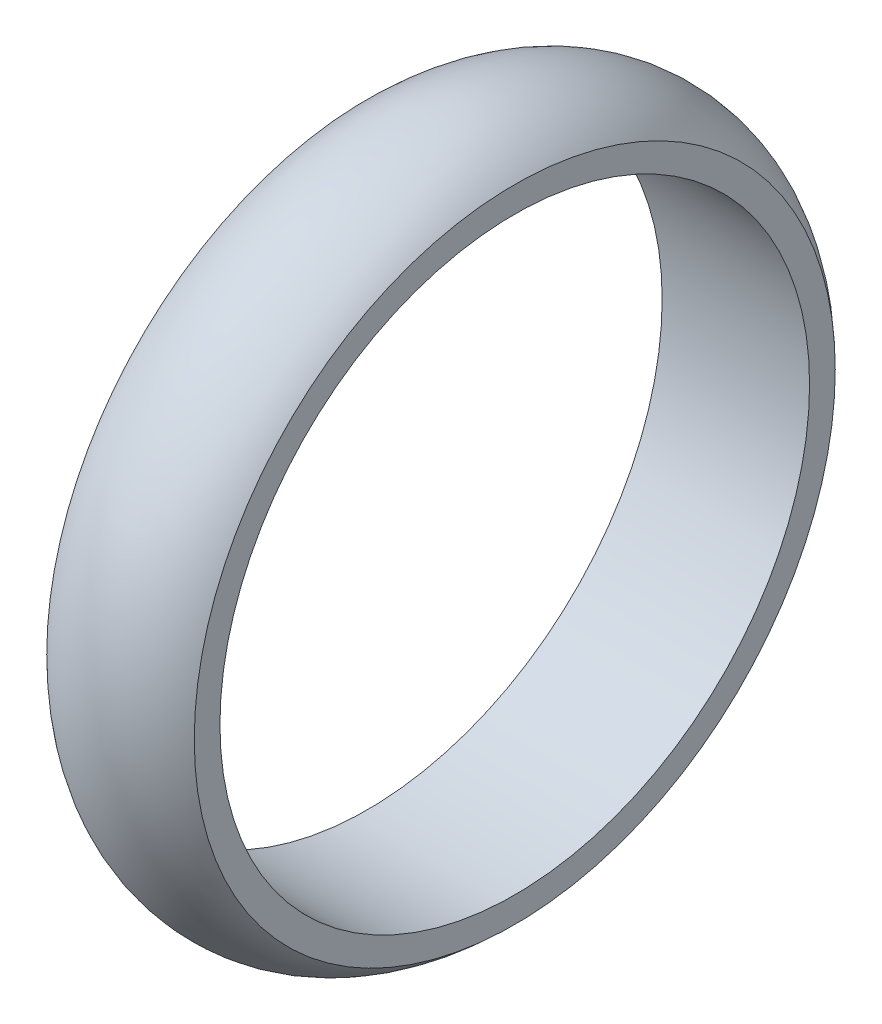
ISO-10303-21;
HEADER;
FILE_DESCRIPTION(('STEP AP214'),'2;1');
FILE_NAME('part.step','',(''),(''),'','','');
FILE_SCHEMA(('AUTOMOTIVE_DESIGN { 1 0 10303 214 1 1 1 1 }'));
ENDSEC;
DATA;
#1=APPLICATION_CONTEXT('core data for automotive mechanical design processes');
#2=APPLICATION_PROTOCOL_DEFINITION('international standard','automotive_design',2000,#1);
#3=PRODUCT_CONTEXT('',#1,'mechanical');
#4=PRODUCT('Part','Part','',(#3));
#5=PRODUCT_RELATED_PRODUCT_CATEGORY('part','',(#4));
#6=PRODUCT_DEFINITION_FORMATION('','',#4);
#7=PRODUCT_DEFINITION_CONTEXT('part definition',#1,'design');
#8=PRODUCT_DEFINITION('design','',#6,#7);
#9=PRODUCT_DEFINITION_SHAPE('','',#8);
#10=(LENGTH_UNIT() NAMED_UNIT(*) SI_UNIT(.MILLI.,.METRE.));
#11=(NAMED_UNIT(*) PLANE_ANGLE_UNIT() SI_UNIT($,.RADIAN.));
#12=(NAMED_UNIT(*) SI_UNIT($,.STERADIAN.) SOLID_ANGLE_UNIT());
#13=UNCERTAINTY_MEASURE_WITH_UNIT(LENGTH_MEASURE(1.E-05),#10,'distance_accuracy_value','');
#14=(GEOMETRIC_REPRESENTATION_CONTEXT(3) GLOBAL_UNCERTAINTY_ASSIGNED_CONTEXT((#13)) GLOBAL_UNIT_ASSIGNED_CONTEXT((#10,
#11,#12)) REPRESENTATION_CONTEXT('',''));
#15=CARTESIAN_POINT('',(0.,0.,0.));
#16=DIRECTION('',(0.,0.,1.));
#17=DIRECTION('',(1.,0.,0.));
#18=AXIS2_PLACEMENT_3D('',#15,#16,#17);
#19=CARTESIAN_POINT('',(-19.7853367191945,0.,0.));
#20=DIRECTION('',(-1.,0.,0.));
#21=DIRECTION('',(0.,0.,1.));
#22=AXIS2_PLACEMENT_3D('',#19,#20,#21);
#23=CYLINDRICAL_SURFACE('',#22,228.6);
#24=CARTESIAN_POINT('',(57.15,0.,0.));
#25=DIRECTION('',(-1.,0.,0.));
#26=DIRECTION('',(0.,0.,1.));
#27=AXIS2_PLACEMENT_3D('',#24,#25,#26);
#28=CIRCLE('',#27,228.6);
#29=CARTESIAN_POINT('',(57.15,0.,228.6));
#30=VERTEX_POINT('',#29);
#31=EDGE_CURVE('E10',#30,#30,#28,.T.);
#32=ORIENTED_EDGE('',*,*,#31,.F.);
#33=EDGE_LOOP('',(#32));
#34=FACE_BOUND('',#33,.T.);
#35=CARTESIAN_POINT('',(-57.15,0.,0.));
#36=DIRECTION('',(-1.,0.,0.));
#37=DIRECTION('',(0.,0.,1.));
#38=AXIS2_PLACEMENT_3D('',#35,#36,#37);
#39=CIRCLE('',#38,228.6);
#40=CARTESIAN_POINT('',(-57.15,0.,228.6));
#41=VERTEX_POINT('',#40);
#42=EDGE_CURVE('E45',#41,#41,#39,.T.);
#43=ORIENTED_EDGE('',*,*,#42,.T.);
#44=EDGE_LOOP('',(#43));
#45=FACE_BOUND('',#44,.T.);
#46=ADVANCED_FACE('F31',(#34,#45),#23,.F.);
#47=CARTESIAN_POINT('',(57.15,228.6,0.));
#48=DIRECTION('',(-1.,0.,0.));
#49=DIRECTION('',(0.,0.,1.));
#50=AXIS2_PLACEMENT_3D('',#47,#48,#49);
#51=PLANE('',#50);
#52=CARTESIAN_POINT('',(57.15,0.,0.));
#53=DIRECTION('',(-1.,0.,0.));
#54=DIRECTION('',(0.,0.,1.));
#55=AXIS2_PLACEMENT_3D('',#52,#53,#54);
#56=CIRCLE('',#55,248.51478328465);
#57=CARTESIAN_POINT('',(57.15,0.,248.51478328465));
#58=VERTEX_POINT('',#57);
#59=EDGE_CURVE('E37',#58,#58,#56,.T.);
#60=ORIENTED_EDGE('',*,*,#59,.F.);
#61=EDGE_LOOP('',(#60));
#62=FACE_BOUND('',#61,.T.);
#63=ORIENTED_EDGE('',*,*,#31,.T.);
#64=EDGE_LOOP('',(#63));
#65=FACE_BOUND('',#64,.T.);
#66=ADVANCED_FACE('F60',(#62,#65),#51,.F.);
#67=CARTESIAN_POINT('',(-0.0426083576751113,0.,0.));
#68=DIRECTION('',(-1.,0.,0.));
#69=DIRECTION('',(0.,0.,1.));
#70=AXIS2_PLACEMENT_3D('',#67,#68,#69);
#71=TOROIDAL_SURFACE('',#70,191.407391642325,80.8223275521331);
#72=CARTESIAN_POINT('',(-57.15,0.,0.));
#73=DIRECTION('',(-1.,0.,0.));
#74=DIRECTION('',(0.,0.,1.));
#75=AXIS2_PLACEMENT_3D('',#72,#73,#74);
#76=CIRCLE('',#75,248.6);
#77=CARTESIAN_POINT('',(-57.15,0.,248.6));
#78=VERTEX_POINT('',#77);
#79=EDGE_CURVE('E41',#78,#78,#76,.T.);
#80=ORIENTED_EDGE('',*,*,#79,.F.);
#81=EDGE_LOOP('',(#80));
#82=FACE_BOUND('',#81,.T.);
#83=ORIENTED_EDGE('',*,*,#59,.T.);
#84=EDGE_LOOP('',(#83));
#85=FACE_BOUND('',#84,.T.);
#86=ADVANCED_FACE('F55',(#82,#85),#71,.T.);
#87=CARTESIAN_POINT('',(-57.15,228.6,0.));
#88=DIRECTION('',(1.,0.,0.));
#89=DIRECTION('',(0.,0.,-1.));
#90=AXIS2_PLACEMENT_3D('',#87,#88,#89);
#91=PLANE('',#90);
#92=ORIENTED_EDGE('',*,*,#42,.F.);
#93=EDGE_LOOP('',(#92));
#94=FACE_BOUND('',#93,.T.);
#95=ORIENTED_EDGE('',*,*,#79,.T.);
#96=EDGE_LOOP('',(#95));
#97=FACE_BOUND('',#96,.T.);
#98=ADVANCED_FACE('F52',(#94,#97),#91,.F.);
#99=CLOSED_SHELL('',(#46,#66,#86,#98));
#100=MANIFOLD_SOLID_BREP('B2',#99);
#101=ADVANCED_BREP_SHAPE_REPRESENTATION('',(#18,#100),#14);
#102=SHAPE_DEFINITION_REPRESENTATION(#9,#101);
ENDSEC;
END-ISO-10303-21;
